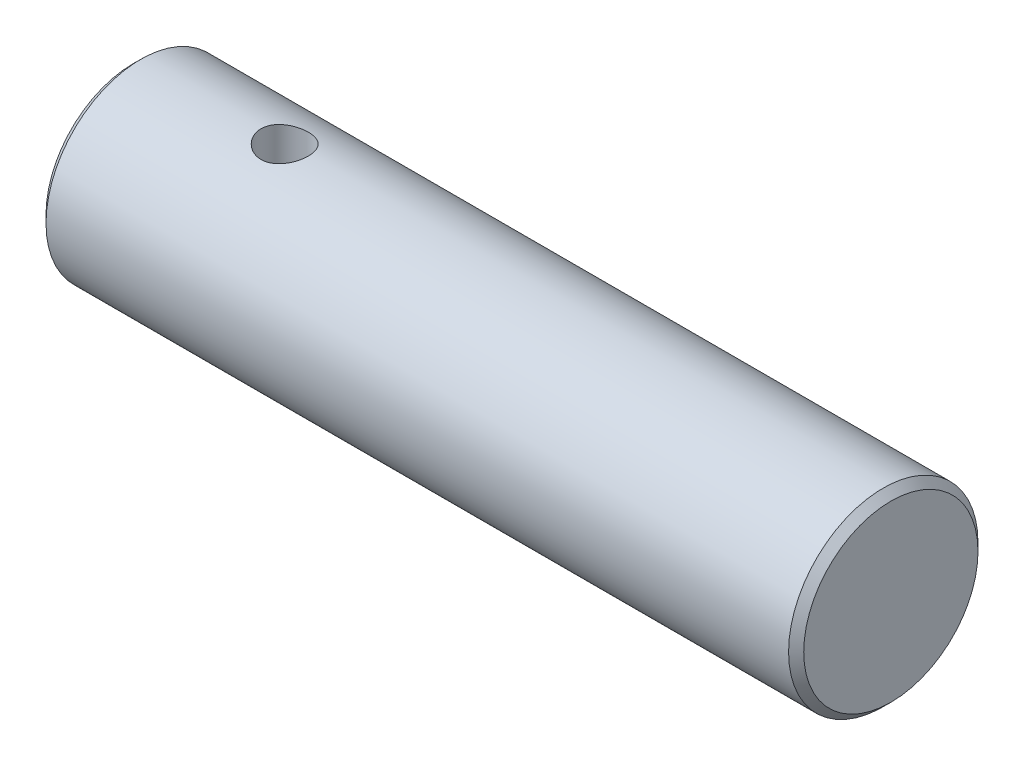
ISO-10303-21;
HEADER;
FILE_DESCRIPTION(('STEP AP214'),'2;1');
FILE_NAME('part.step','',(''),(''),'','','');
FILE_SCHEMA(('AUTOMOTIVE_DESIGN { 1 0 10303 214 1 1 1 1 }'));
ENDSEC;
DATA;
#1=APPLICATION_CONTEXT('core data for automotive mechanical design processes');
#2=APPLICATION_PROTOCOL_DEFINITION('international standard','automotive_design',2000,#1);
#3=PRODUCT_CONTEXT('',#1,'mechanical');
#4=PRODUCT('Part','Part','',(#3));
#5=PRODUCT_RELATED_PRODUCT_CATEGORY('part','',(#4));
#6=PRODUCT_DEFINITION_FORMATION('','',#4);
#7=PRODUCT_DEFINITION_CONTEXT('part definition',#1,'design');
#8=PRODUCT_DEFINITION('design','',#6,#7);
#9=PRODUCT_DEFINITION_SHAPE('','',#8);
#10=(LENGTH_UNIT() NAMED_UNIT(*) SI_UNIT(.MILLI.,.METRE.));
#11=(NAMED_UNIT(*) PLANE_ANGLE_UNIT() SI_UNIT($,.RADIAN.));
#12=(NAMED_UNIT(*) SI_UNIT($,.STERADIAN.) SOLID_ANGLE_UNIT());
#13=UNCERTAINTY_MEASURE_WITH_UNIT(LENGTH_MEASURE(1.E-05),#10,'distance_accuracy_value','');
#14=(GEOMETRIC_REPRESENTATION_CONTEXT(3) GLOBAL_UNCERTAINTY_ASSIGNED_CONTEXT((#13)) GLOBAL_UNIT_ASSIGNED_CONTEXT((#10,
#11,#12)) REPRESENTATION_CONTEXT('',''));
#15=CARTESIAN_POINT('',(0.,0.,0.));
#16=DIRECTION('',(0.,0.,1.));
#17=DIRECTION('',(1.,0.,0.));
#18=AXIS2_PLACEMENT_3D('',#15,#16,#17);
#19=CARTESIAN_POINT('',(25.4,0.,0.));
#20=DIRECTION('',(-1.,0.,0.));
#21=DIRECTION('',(0.,0.,1.));
#22=AXIS2_PLACEMENT_3D('',#19,#20,#21);
#23=CYLINDRICAL_SURFACE('',#22,3.175);
#24=CARTESIAN_POINT('',(4.28625,-3.175,0.));
#25=CARTESIAN_POINT('',(4.28625123070311,-3.17499925846823,0.0438552635877327));
#26=CARTESIAN_POINT('',(4.28989677895113,-3.17408230928092,0.0877242751854455));
#27=CARTESIAN_POINT('',(4.30436080923329,-3.17051326901651,0.17420501299524));
#28=CARTESIAN_POINT('',(4.31518335671378,-3.167860194514,0.216816012302433));
#29=CARTESIAN_POINT('',(4.34363243829035,-3.16111268934038,0.299519378196614));
#30=CARTESIAN_POINT('',(4.36125080182017,-3.15701999003938,0.339614702315043));
#31=CARTESIAN_POINT('',(4.40276265223206,-3.14782911098185,0.416280669799426));
#32=CARTESIAN_POINT('',(4.4266563507796,-3.14273089731102,0.452851194217885));
#33=CARTESIAN_POINT('',(4.48056041785869,-3.13196506358995,0.52218268653007));
#34=CARTESIAN_POINT('',(4.5106757084159,-3.12628865866099,0.554860719323984));
#35=CARTESIAN_POINT('',(4.57594345843097,-3.11506457312193,0.614758807311749));
#36=CARTESIAN_POINT('',(4.61109648589252,-3.10951690710918,0.641978246218918));
#37=CARTESIAN_POINT('',(4.68608580748189,-3.0990898547443,0.690576545564488));
#38=CARTESIAN_POINT('',(4.72598391797051,-3.09422162074029,0.711862630927168));
#39=CARTESIAN_POINT('',(4.80893353450255,-3.08583274338135,0.747393364107988));
#40=CARTESIAN_POINT('',(4.85198453513488,-3.08231188460184,0.76163913766998));
#41=CARTESIAN_POINT('',(4.93910593446548,-3.07710668929704,0.782401934475604));
#42=CARTESIAN_POINT('',(4.98313863249302,-3.07538697360746,0.789068075326392));
#43=CARTESIAN_POINT('',(5.0717283677699,-3.07387287676221,0.794946855973405));
#44=CARTESIAN_POINT('',(5.11628531853635,-3.07407818237407,0.79416070837868));
#45=CARTESIAN_POINT('',(5.20351586493145,-3.07635912908627,0.78527620262162));
#46=CARTESIAN_POINT('',(5.24620893302528,-3.07838931671828,0.777355538350817));
#47=CARTESIAN_POINT('',(5.32964022277389,-3.08401883870473,0.754710298902894));
#48=CARTESIAN_POINT('',(5.37037830493617,-3.08761828484493,0.739985239011737));
#49=CARTESIAN_POINT('',(5.44921970026672,-3.09602247774299,0.703997765408411));
#50=CARTESIAN_POINT('',(5.4872922659053,-3.10083902452569,0.682670861410749));
#51=CARTESIAN_POINT('',(5.55938198391299,-3.11112805322879,0.634130196057914));
#52=CARTESIAN_POINT('',(5.59339842501892,-3.11660064985464,0.606915404578012));
#53=CARTESIAN_POINT('',(5.65742857997162,-3.12777653452301,0.546451062227145));
#54=CARTESIAN_POINT('',(5.6873005009908,-3.1334819509876,0.513051561612768));
#55=CARTESIAN_POINT('',(5.74104624080382,-3.14433990118774,0.441648806345708));
#56=CARTESIAN_POINT('',(5.76491987638114,-3.14949241803232,0.403645411120454));
#57=CARTESIAN_POINT('',(5.8060434352104,-3.15868966566505,0.323911324427237));
#58=CARTESIAN_POINT('',(5.82327032588463,-3.16273053067588,0.282168278906231));
#59=CARTESIAN_POINT('',(5.85042290760465,-3.16922106074626,0.196255220975609));
#60=CARTESIAN_POINT('',(5.86034999527127,-3.17167103017036,0.152085674550465));
#61=CARTESIAN_POINT('',(5.87240462844155,-3.17465868364436,0.0637857343313895));
#62=CARTESIAN_POINT('',(5.87472526796485,-3.17524369981464,0.0196832643270947));
#63=CARTESIAN_POINT('',(5.87203073641231,-3.17457034214314,-0.0682798962491309));
#64=CARTESIAN_POINT('',(5.86701622568546,-3.1733121342381,-0.112140608228598));
#65=CARTESIAN_POINT('',(5.84995289430956,-3.1691240334656,-0.19770421722756));
#66=CARTESIAN_POINT('',(5.83800941474343,-3.16621918923325,-0.239429458787632));
#67=CARTESIAN_POINT('',(5.80754750136828,-3.15906523927229,-0.320281983922787));
#68=CARTESIAN_POINT('',(5.78902840355095,-3.15481599779068,-0.359409004654769));
#69=CARTESIAN_POINT('',(5.74556671513712,-3.14533125444339,-0.434722658635794));
#70=CARTESIAN_POINT('',(5.72051597385671,-3.14007958981668,-0.470844796304793));
#71=CARTESIAN_POINT('',(5.66484033992827,-3.12919802778343,-0.538441166386218));
#72=CARTESIAN_POINT('',(5.63421448528605,-3.12356806520694,-0.56991459495655));
#73=CARTESIAN_POINT('',(5.56736146238647,-3.11239406391741,-0.62811584227182));
#74=CARTESIAN_POINT('',(5.53101525716122,-3.10685552632436,-0.654708213283326));
#75=CARTESIAN_POINT('',(5.45426231426189,-3.09664564807955,-0.701416109977553));
#76=CARTESIAN_POINT('',(5.4138557569338,-3.09197426893801,-0.721531923158575));
#77=CARTESIAN_POINT('',(5.33034572188975,-3.0840790846376,-0.754565960072417));
#78=CARTESIAN_POINT('',(5.28725996333463,-3.08084672591967,-0.767526826562776));
#79=CARTESIAN_POINT('',(5.19942781661701,-3.07618735414389,-0.785995411725542));
#80=CARTESIAN_POINT('',(5.15468179382864,-3.07475994626799,-0.791504760374123));
#81=CARTESIAN_POINT('',(5.06617762487662,-3.0739021855376,-0.794828754051739));
#82=CARTESIAN_POINT('',(5.02242802391316,-3.07441564402039,-0.792859887575313));
#83=CARTESIAN_POINT('',(4.93590585891319,-3.07725185183317,-0.781778809773892));
#84=CARTESIAN_POINT('',(4.89313327525944,-3.07957456480274,-0.772666742005082));
#85=CARTESIAN_POINT('',(4.81001469041122,-3.08573625444607,-0.747676156538479));
#86=CARTESIAN_POINT('',(4.76965575931039,-3.08956612229214,-0.731838243310032));
#87=CARTESIAN_POINT('',(4.69213915164734,-3.09831187404388,-0.69387768344935));
#88=CARTESIAN_POINT('',(4.65498192002192,-3.10322790855576,-0.671754165143092));
#89=CARTESIAN_POINT('',(4.5838773421531,-3.11375231464442,-0.621171683653818));
#90=CARTESIAN_POINT('',(4.55003901531316,-3.11937540140138,-0.592562507041068));
#91=CARTESIAN_POINT('',(4.4875730221291,-3.13059247751159,-0.530113542254568));
#92=CARTESIAN_POINT('',(4.45894659489855,-3.13618645963902,-0.496272513750689));
#93=CARTESIAN_POINT('',(4.40721151588456,-3.14683592780222,-0.42358076463012));
#94=CARTESIAN_POINT('',(4.38421218359879,-3.15187982656105,-0.384650415142421));
#95=CARTESIAN_POINT('',(4.34512113419397,-3.16073856132667,-0.303353289824293));
#96=CARTESIAN_POINT('',(4.32902446749015,-3.16455427751551,-0.260989002318608));
#97=CARTESIAN_POINT('',(4.30658490645056,-3.16996264853432,-0.18225042567467));
#98=CARTESIAN_POINT('',(4.29897580055089,-3.17183867923715,-0.146251173772186));
#99=CARTESIAN_POINT('',(4.28880802150006,-3.17435761935239,-0.0735044628546165));
#100=CARTESIAN_POINT('',(4.28624896849261,-3.17500062151098,-0.0367570603242178));
#101=CARTESIAN_POINT('',(4.28625,-3.175,0.));
#102=B_SPLINE_CURVE_WITH_KNOTS('',3,(#24,#25,#26,#27,#28,#29,#30,#31,#32,#33,#34,#35,#36,#37,
#38,#39,#40,#41,#42,#43,#44,#45,#46,#47,#48,#49,#50,#51,#52,#53,#54,#55,#56,#57,#58,#59,#60,#61,
#62,#63,#64,#65,#66,#67,#68,#69,#70,#71,#72,#73,#74,#75,#76,#77,#78,#79,#80,#81,#82,#83,#84,#85,
#86,#87,#88,#89,#90,#91,#92,#93,#94,#95,#96,#97,#98,#99,#100,#101),.UNSPECIFIED.,.T.,.F.,(4,2,2,
2,2,2,2,2,2,2,2,2,2,2,2,2,2,2,2,2,2,2,2,2,2,2,2,2,2,2,2,2,2,2,2,2,2,2,4),(0.,0.131431089516375,
0.262936692483397,0.394284677459731,0.525637093339603,0.659418054188194,0.793214110694495,
0.928997843263228,1.06475985702124,1.19780206156782,1.33082261834635,1.46061904666214,
1.59042472250779,1.72154070999928,1.85267965567469,1.98755794262773,2.12244034891239,
2.25778604517323,2.39310583993574,2.52496271818992,2.6568077267216,2.78669895263678,
2.91660329874712,3.04881273419999,3.18104500425077,3.31652302787369,3.45199503671615,
3.58665068066595,3.72127686471066,3.85203583794266,3.98279218339235,4.11277011962708,
4.24276608972444,4.37615317516911,4.50957193170179,4.64540698160199,4.78114446688798,
4.89131103556887,5.00146931739442),.UNSPECIFIED.);
#103=CARTESIAN_POINT('',(4.28625,-3.175,0.));
#104=VERTEX_POINT('',#103);
#105=EDGE_CURVE('E10',#104,#104,#102,.T.);
#106=ORIENTED_EDGE('',*,*,#105,.T.);
#107=EDGE_LOOP('',(#106));
#108=FACE_BOUND('',#107,.T.);
#109=CARTESIAN_POINT('',(5.08,3.07418053105214,0.79375));
#110=CARTESIAN_POINT('',(5.0361688865918,3.07418136795391,0.793748754954468));
#111=CARTESIAN_POINT('',(4.99232399470136,3.07512817233802,0.790107082952655));
#112=CARTESIAN_POINT('',(4.90589329395911,3.07880341258223,0.775659842341841));
#113=CARTESIAN_POINT('',(4.86330823296215,3.08153288532631,0.764850104391599));
#114=CARTESIAN_POINT('',(4.78065987661528,3.08844545039078,0.736438455880648));
#115=CARTESIAN_POINT('',(4.74059340316228,3.09262666548804,0.718845313593124));
#116=CARTESIAN_POINT('',(4.66397630432135,3.10196925974547,0.677392962351167));
#117=CARTESIAN_POINT('',(4.62742582829028,3.10713068051635,0.653533487368201));
#118=CARTESIAN_POINT('',(4.55807392762849,3.11797927441417,0.599664925671336));
#119=CARTESIAN_POINT('',(4.52536128188866,3.12367484744913,0.569543211845986));
#120=CARTESIAN_POINT('',(4.4653957572908,3.13487712976506,0.504247805352011));
#121=CARTESIAN_POINT('',(4.43814338886515,3.14038382134936,0.469073640902261));
#122=CARTESIAN_POINT('',(4.38950878902701,3.15068081927675,0.394063601342555));
#123=CARTESIAN_POINT('',(4.36821377175872,3.15546005749659,0.354169527941948));
#124=CARTESIAN_POINT('',(4.33266543798141,3.16366782786529,0.271228561012956));
#125=CARTESIAN_POINT('',(4.31841108251683,3.16709655928662,0.228182133738942));
#126=CARTESIAN_POINT('',(4.2976330625213,3.1721576093429,0.141083905904446));
#127=CARTESIAN_POINT('',(4.29095863792631,3.17382491295568,0.0970701384567998));
#128=CARTESIAN_POINT('',(4.28505671458001,3.17529716129069,0.00851815011592973));
#129=CARTESIAN_POINT('',(4.28582811482345,3.17510238135704,-0.0360199922658366));
#130=CARTESIAN_POINT('',(4.29468751495442,3.17289845147747,-0.123310846193082));
#131=CARTESIAN_POINT('',(4.3026127832046,3.17092965743227,-0.166081246133347));
#132=CARTESIAN_POINT('',(4.3252933782404,3.16544590596641,-0.249664733884613));
#133=CARTESIAN_POINT('',(4.34004906860733,3.16193086624005,-0.290477717375285));
#134=CARTESIAN_POINT('',(4.37610331619314,3.15368784330034,-0.369416570904559));
#135=CARTESIAN_POINT('',(4.3974597866801,3.14894918753179,-0.407514829627163));
#136=CARTESIAN_POINT('',(4.44606542811941,3.13877294459564,-0.479643775232763));
#137=CARTESIAN_POINT('',(4.473315624268,3.13333523589666,-0.51367375284912));
#138=CARTESIAN_POINT('',(4.5338075255794,3.12217979121823,-0.577670640348684));
#139=CARTESIAN_POINT('',(4.56719142832042,3.11645845949479,-0.607502657765939));
#140=CARTESIAN_POINT('',(4.63854799159903,3.10551526316554,-0.661174998420646));
#141=CARTESIAN_POINT('',(4.67652086648839,3.10029342191146,-0.685015041611526));
#142=CARTESIAN_POINT('',(4.7562420858423,3.09092757744048,-0.726113077411687));
#143=CARTESIAN_POINT('',(4.79800784437444,3.08678892332916,-0.743338593782827));
#144=CARTESIAN_POINT('',(4.88397088611427,3.08012668244436,-0.770481711380096));
#145=CARTESIAN_POINT('',(4.92816764681465,3.07760275007244,-0.780400876451373));
#146=CARTESIAN_POINT('',(5.01648714173359,3.07452825542427,-0.792425910276194));
#147=CARTESIAN_POINT('',(5.06058099938216,3.07392733287233,-0.794731225469482));
#148=CARTESIAN_POINT('',(5.14852346486357,3.0746298155523,-0.792009144488686));
#149=CARTESIAN_POINT('',(5.19237209489952,3.07593304548402,-0.786982423316994));
#150=CARTESIAN_POINT('',(5.27783877912312,3.08024873520573,-0.769913834800208));
#151=CARTESIAN_POINT('',(5.31948159068624,3.08323288049414,-0.757988091679454));
#152=CARTESIAN_POINT('',(5.40017698786791,3.09054728051031,-0.727588740930422));
#153=CARTESIAN_POINT('',(5.43922926600007,3.09487769468935,-0.709114357648733));
#154=CARTESIAN_POINT('',(5.51448010572288,3.10450273527111,-0.665724687069857));
#155=CARTESIAN_POINT('',(5.55060765671369,3.10981461032609,-0.640690156842813));
#156=CARTESIAN_POINT('',(5.61822230518943,3.1207617387527,-0.585041607516725));
#157=CARTESIAN_POINT('',(5.6497086385364,3.12639704516289,-0.554426671501818));
#158=CARTESIAN_POINT('',(5.70795500601628,3.13752675462535,-0.487571034781627));
#159=CARTESIAN_POINT('',(5.73457706985925,3.14301410404633,-0.451208737321952));
#160=CARTESIAN_POINT('',(5.78133713775702,3.15308366274861,-0.374414004388899));
#161=CARTESIAN_POINT('',(5.80147548002311,3.15766591923757,-0.333981781360089));
#162=CARTESIAN_POINT('',(5.83452161596262,3.16538011746915,-0.250474322624054));
#163=CARTESIAN_POINT('',(5.84748141029035,3.16852246032115,-0.207420671190881));
#164=CARTESIAN_POINT('',(5.86595865623817,3.17304830653163,-0.119657622253054));
#165=CARTESIAN_POINT('',(5.87147754414965,3.17443214932407,-0.0749485460014876));
#166=CARTESIAN_POINT('',(5.87483552422558,3.17527121968244,0.0135600491143899));
#167=CARTESIAN_POINT('',(5.87287823159447,3.17477758236007,0.0573514751542885));
#168=CARTESIAN_POINT('',(5.86180578708512,3.1720305531308,0.143960450279199));
#169=CARTESIAN_POINT('',(5.85269084808335,3.16977721355944,0.186778028288578));
#170=CARTESIAN_POINT('',(5.82767105055683,3.16377187327833,0.270010759543072));
#171=CARTESIAN_POINT('',(5.81180300893152,3.16002800573993,0.310437605073683));
#172=CARTESIAN_POINT('',(5.77376085290341,3.15143585574997,0.388077910851665));
#173=CARTESIAN_POINT('',(5.75158594356853,3.14658743409321,0.425290965254134));
#174=CARTESIAN_POINT('',(5.70093853301483,3.13616379434565,0.496412780686471));
#175=CARTESIAN_POINT('',(5.67232788656728,3.13057394700607,0.530221021963591));
#176=CARTESIAN_POINT('',(5.60988936124579,3.11936327685983,0.592625672340306));
#177=CARTESIAN_POINT('',(5.57606016159726,3.11374244655986,0.621220758022866));
#178=CARTESIAN_POINT('',(5.50338512747772,3.10298683964417,0.672911108517897));
#179=CARTESIAN_POINT('',(5.46445747704134,3.09786308710998,0.695893816685734));
#180=CARTESIAN_POINT('',(5.38316845487374,3.088830147179,0.73495447418865));
#181=CARTESIAN_POINT('',(5.34080960815234,3.08492007669321,0.751037447121648));
#182=CARTESIAN_POINT('',(5.26210449686289,3.07936827563419,0.773447882048922));
#183=CARTESIAN_POINT('',(5.2261348007715,3.07743751260823,0.781044579160439));
#184=CARTESIAN_POINT('',(5.15344658523009,3.07484334373159,0.791195944729676));
#185=CARTESIAN_POINT('',(5.11672812992606,3.07417982977319,0.793751043281599));
#186=CARTESIAN_POINT('',(5.08,3.07418053105214,0.79375));
#187=B_SPLINE_CURVE_WITH_KNOTS('',3,(#109,#110,#111,#112,#113,#114,#115,#116,#117,#118,#119,
#120,#121,#122,#123,#124,#125,#126,#127,#128,#129,#130,#131,#132,#133,#134,#135,#136,#137,#138,
#139,#140,#141,#142,#143,#144,#145,#146,#147,#148,#149,#150,#151,#152,#153,#154,#155,#156,#157,
#158,#159,#160,#161,#162,#163,#164,#165,#166,#167,#168,#169,#170,#171,#172,#173,#174,#175,#176,
#177,#178,#179,#180,#181,#182,#183,#184,#185,#186),.UNSPECIFIED.,.T.,.F.,(4,2,2,2,2,2,2,2,2,2,2,
2,2,2,2,2,2,2,2,2,2,2,2,2,2,2,2,2,2,2,2,2,2,2,2,2,2,2,4),(0.,0.131358462735965,0.26279339787403,
0.394059005845641,0.525330187419073,0.659206054533128,0.793094430669004,0.928851001033824,
1.06458753248495,1.19757428438065,1.33054137198504,1.46055798400784,1.59058151757162,
1.72177987572829,1.85300107383423,1.98777373133625,2.1225526865298,2.25798517159711,
2.39338866038174,2.52521584983888,2.657030903779,2.78668926087466,2.91636298048343,
3.04858053557325,3.18081983493044,3.31636792578532,3.45190894488001,3.58645483113243,
3.72097474275663,3.8518574414251,3.98273624764234,4.11291048304751,4.24310113318881,
4.3764107816185,4.50975422519092,4.64558531534928,4.78131734030945,4.89139810125845,
5.00146947091141),.UNSPECIFIED.);
#188=CARTESIAN_POINT('',(5.08,3.07418053105214,0.79375));
#189=VERTEX_POINT('',#188);
#190=EDGE_CURVE('E42',#189,#189,#187,.T.);
#191=ORIENTED_EDGE('',*,*,#190,.T.);
#192=EDGE_LOOP('',(#191));
#193=FACE_BOUND('',#192,.T.);
#194=CARTESIAN_POINT('',(25.146,0.,0.));
#195=DIRECTION('',(1.,0.,0.));
#196=DIRECTION('',(0.,0.,-1.));
#197=AXIS2_PLACEMENT_3D('',#194,#195,#196);
#198=CIRCLE('',#197,3.175);
#199=CARTESIAN_POINT('',(25.146,0.,-3.175));
#200=VERTEX_POINT('',#199);
#201=EDGE_CURVE('E50',#200,#200,#198,.F.);
#202=ORIENTED_EDGE('',*,*,#201,.T.);
#203=EDGE_LOOP('',(#202));
#204=FACE_BOUND('',#203,.T.);
#205=CARTESIAN_POINT('',(0.253999999999997,0.,0.));
#206=DIRECTION('',(1.,0.,0.));
#207=DIRECTION('',(0.,0.,-1.));
#208=AXIS2_PLACEMENT_3D('',#205,#206,#207);
#209=CIRCLE('',#208,3.175);
#210=CARTESIAN_POINT('',(0.253999999999997,0.,-3.175));
#211=VERTEX_POINT('',#210);
#212=EDGE_CURVE('E83',#211,#211,#209,.T.);
#213=ORIENTED_EDGE('',*,*,#212,.T.);
#214=EDGE_LOOP('',(#213));
#215=FACE_BOUND('',#214,.T.);
#216=ADVANCED_FACE('F31',(#108,#193,#204,#215),#23,.T.);
#217=CARTESIAN_POINT('',(25.4,0.,0.));
#218=DIRECTION('',(1.,0.,0.));
#219=DIRECTION('',(0.,0.,-1.));
#220=AXIS2_PLACEMENT_3D('',#217,#218,#219);
#221=PLANE('',#220);
#222=CARTESIAN_POINT('',(25.4,0.,0.));
#223=DIRECTION('',(1.,0.,0.));
#224=DIRECTION('',(0.,0.,-1.));
#225=AXIS2_PLACEMENT_3D('',#222,#223,#224);
#226=CIRCLE('',#225,2.921);
#227=CARTESIAN_POINT('',(25.4,0.,-2.921));
#228=VERTEX_POINT('',#227);
#229=EDGE_CURVE('E85',#228,#228,#226,.T.);
#230=ORIENTED_EDGE('',*,*,#229,.T.);
#231=EDGE_LOOP('',(#230));
#232=FACE_BOUND('',#231,.T.);
#233=ADVANCED_FACE('F62',(#232),#221,.T.);
#234=CARTESIAN_POINT('',(0.,0.,0.));
#235=DIRECTION('',(1.,0.,0.));
#236=DIRECTION('',(0.,0.,-1.));
#237=AXIS2_PLACEMENT_3D('',#234,#235,#236);
#238=PLANE('',#237);
#239=CARTESIAN_POINT('',(0.,0.,0.));
#240=DIRECTION('',(1.,0.,0.));
#241=DIRECTION('',(0.,0.,-1.));
#242=AXIS2_PLACEMENT_3D('',#239,#240,#241);
#243=CIRCLE('',#242,2.921);
#244=CARTESIAN_POINT('',(0.,0.,-2.921));
#245=VERTEX_POINT('',#244);
#246=EDGE_CURVE('E46',#245,#245,#243,.F.);
#247=ORIENTED_EDGE('',*,*,#246,.T.);
#248=EDGE_LOOP('',(#247));
#249=FACE_BOUND('',#248,.T.);
#250=ADVANCED_FACE('F65',(#249),#238,.F.);
#251=CARTESIAN_POINT('',(25.4,0.,0.));
#252=DIRECTION('',(-1.,0.,0.));
#253=DIRECTION('',(0.,0.,1.));
#254=AXIS2_PLACEMENT_3D('',#251,#252,#253);
#255=CONICAL_SURFACE('',#254,2.921,0.785398163397447);
#256=ORIENTED_EDGE('',*,*,#201,.F.);
#257=EDGE_LOOP('',(#256));
#258=FACE_BOUND('',#257,.T.);
#259=ORIENTED_EDGE('',*,*,#229,.F.);
#260=EDGE_LOOP('',(#259));
#261=FACE_BOUND('',#260,.T.);
#262=ADVANCED_FACE('F68',(#258,#261),#255,.T.);
#263=CARTESIAN_POINT('',(0.253999999999997,0.,0.));
#264=DIRECTION('',(1.,0.,0.));
#265=DIRECTION('',(0.,0.,-1.));
#266=AXIS2_PLACEMENT_3D('',#263,#264,#265);
#267=CONICAL_SURFACE('',#266,3.175,0.785398163397446);
#268=ORIENTED_EDGE('',*,*,#246,.F.);
#269=EDGE_LOOP('',(#268));
#270=FACE_BOUND('',#269,.T.);
#271=ORIENTED_EDGE('',*,*,#212,.F.);
#272=EDGE_LOOP('',(#271));
#273=FACE_BOUND('',#272,.T.);
#274=ADVANCED_FACE('F33',(#270,#273),#267,.T.);
#275=CARTESIAN_POINT('',(5.08,-3.175,0.));
#276=DIRECTION('',(0.,1.,0.));
#277=DIRECTION('',(0.,0.,1.));
#278=AXIS2_PLACEMENT_3D('',#275,#276,#277);
#279=CYLINDRICAL_SURFACE('',#278,0.79375);
#280=ORIENTED_EDGE('',*,*,#190,.F.);
#281=EDGE_LOOP('',(#280));
#282=FACE_BOUND('',#281,.T.);
#283=ORIENTED_EDGE('',*,*,#105,.F.);
#284=EDGE_LOOP('',(#283));
#285=FACE_BOUND('',#284,.T.);
#286=ADVANCED_FACE('F57',(#282,#285),#279,.F.);
#287=CLOSED_SHELL('',(#216,#233,#250,#262,#274,#286));
#288=MANIFOLD_SOLID_BREP('B2',#287);
#289=ADVANCED_BREP_SHAPE_REPRESENTATION('',(#18,#288),#14);
#290=SHAPE_DEFINITION_REPRESENTATION(#9,#289);
ENDSEC;
END-ISO-10303-21;
